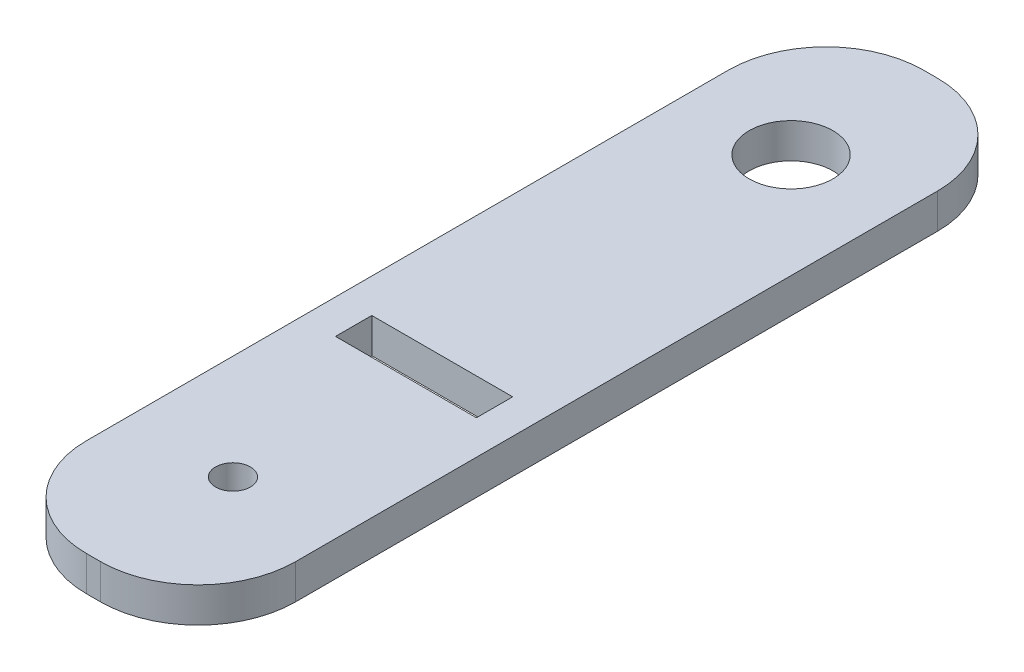
ISO-10303-21;
HEADER;
FILE_DESCRIPTION(('STEP AP214'),'2;1');
FILE_NAME('part.step','',(''),(''),'','','');
FILE_SCHEMA(('AUTOMOTIVE_DESIGN { 1 0 10303 214 1 1 1 1 }'));
ENDSEC;
DATA;
#1=APPLICATION_CONTEXT('core data for automotive mechanical design processes');
#2=APPLICATION_PROTOCOL_DEFINITION('international standard','automotive_design',2000,#1);
#3=PRODUCT_CONTEXT('',#1,'mechanical');
#4=PRODUCT('Part','Part','',(#3));
#5=PRODUCT_RELATED_PRODUCT_CATEGORY('part','',(#4));
#6=PRODUCT_DEFINITION_FORMATION('','',#4);
#7=PRODUCT_DEFINITION_CONTEXT('part definition',#1,'design');
#8=PRODUCT_DEFINITION('design','',#6,#7);
#9=PRODUCT_DEFINITION_SHAPE('','',#8);
#10=(LENGTH_UNIT() NAMED_UNIT(*) SI_UNIT(.MILLI.,.METRE.));
#11=(NAMED_UNIT(*) PLANE_ANGLE_UNIT() SI_UNIT($,.RADIAN.));
#12=(NAMED_UNIT(*) SI_UNIT($,.STERADIAN.) SOLID_ANGLE_UNIT());
#13=UNCERTAINTY_MEASURE_WITH_UNIT(LENGTH_MEASURE(1.E-05),#10,'distance_accuracy_value','');
#14=(GEOMETRIC_REPRESENTATION_CONTEXT(3) GLOBAL_UNCERTAINTY_ASSIGNED_CONTEXT((#13)) GLOBAL_UNIT_ASSIGNED_CONTEXT((#10,
#11,#12)) REPRESENTATION_CONTEXT('',''));
#15=CARTESIAN_POINT('',(0.,0.,0.));
#16=DIRECTION('',(0.,0.,1.));
#17=DIRECTION('',(1.,0.,0.));
#18=AXIS2_PLACEMENT_3D('',#15,#16,#17);
#19=CARTESIAN_POINT('',(-16.8898118207731,10.0001557639159,33.1505325625904));
#20=DIRECTION('',(0.,-1.,0.));
#21=DIRECTION('',(0.,0.,-1.));
#22=AXIS2_PLACEMENT_3D('',#19,#20,#21);
#23=CYLINDRICAL_SURFACE('',#22,8.89);
#24=DIRECTION('',(0.,-1.,0.));
#25=VECTOR('',#24,1.);
#26=CARTESIAN_POINT('',(-16.8898118207731,10.0001557639159,42.0405325625904));
#27=LINE('',#26,#25);
#28=CARTESIAN_POINT('',(-16.8898118207731,10.0001557639159,42.0405325625904));
#29=VERTEX_POINT('',#28);
#30=CARTESIAN_POINT('',(-16.8898118207731,6.82515576391594,42.0405325625904));
#31=VERTEX_POINT('',#30);
#32=EDGE_CURVE('E220',#29,#31,#27,.T.);
#33=ORIENTED_EDGE('',*,*,#32,.F.);
#34=CARTESIAN_POINT('',(-16.8898118207731,10.0001557639159,33.1505325625904));
#35=DIRECTION('',(0.,1.,0.));
#36=DIRECTION('',(0.,0.,1.));
#37=AXIS2_PLACEMENT_3D('',#34,#35,#36);
#38=CIRCLE('',#37,8.89);
#39=CARTESIAN_POINT('',(-25.7798118207731,10.0001557639159,33.1505325625904));
#40=VERTEX_POINT('',#39);
#41=EDGE_CURVE('E39',#40,#29,#38,.T.);
#42=ORIENTED_EDGE('',*,*,#41,.F.);
#43=DIRECTION('',(0.,-1.,0.));
#44=VECTOR('',#43,1.);
#45=CARTESIAN_POINT('',(-25.7798118207731,10.0001557639159,33.1505325625904));
#46=LINE('',#45,#44);
#47=CARTESIAN_POINT('',(-25.7798118207731,6.82515576391594,33.1505325625904));
#48=VERTEX_POINT('',#47);
#49=EDGE_CURVE('E223',#48,#40,#46,.F.);
#50=ORIENTED_EDGE('',*,*,#49,.F.);
#51=CARTESIAN_POINT('',(-16.8898118207731,6.82515576391594,33.1505325625904));
#52=DIRECTION('',(0.,1.,0.));
#53=DIRECTION('',(0.,0.,1.));
#54=AXIS2_PLACEMENT_3D('',#51,#52,#53);
#55=CIRCLE('',#54,8.89);
#56=EDGE_CURVE('E11',#31,#48,#55,.F.);
#57=ORIENTED_EDGE('',*,*,#56,.F.);
#58=EDGE_LOOP('',(#33,#42,#50,#57));
#59=FACE_BOUND('',#58,.T.);
#60=ADVANCED_FACE('F32',(#59),#23,.T.);
#61=CARTESIAN_POINT('',(-15.6198118207731,10.0001557639159,33.1505325625904));
#62=DIRECTION('',(0.,-1.,0.));
#63=DIRECTION('',(0.,0.,-1.));
#64=AXIS2_PLACEMENT_3D('',#61,#62,#63);
#65=CYLINDRICAL_SURFACE('',#64,8.89);
#66=DIRECTION('',(0.,-1.,0.));
#67=VECTOR('',#66,1.);
#68=CARTESIAN_POINT('',(-6.72981182077306,10.0001557639159,33.1505325625904));
#69=LINE('',#68,#67);
#70=CARTESIAN_POINT('',(-6.72981182077306,10.0001557639159,33.1505325625903));
#71=VERTEX_POINT('',#70);
#72=CARTESIAN_POINT('',(-6.72981182077306,6.82515576391594,33.1505325625903));
#73=VERTEX_POINT('',#72);
#74=EDGE_CURVE('E209',#71,#73,#69,.T.);
#75=ORIENTED_EDGE('',*,*,#74,.F.);
#76=CARTESIAN_POINT('',(-15.6198118207731,10.0001557639159,33.1505325625904));
#77=DIRECTION('',(0.,1.,0.));
#78=DIRECTION('',(0.,0.,1.));
#79=AXIS2_PLACEMENT_3D('',#76,#77,#78);
#80=CIRCLE('',#79,8.89);
#81=CARTESIAN_POINT('',(-15.6198118207731,10.0001557639159,42.0405325625904));
#82=VERTEX_POINT('',#81);
#83=EDGE_CURVE('E215',#82,#71,#80,.T.);
#84=ORIENTED_EDGE('',*,*,#83,.F.);
#85=DIRECTION('',(0.,-1.,0.));
#86=VECTOR('',#85,1.);
#87=CARTESIAN_POINT('',(-15.6198118207731,10.0001557639159,42.0405325625904));
#88=LINE('',#87,#86);
#89=CARTESIAN_POINT('',(-15.6198118207731,6.82515576391594,42.0405325625904));
#90=VERTEX_POINT('',#89);
#91=EDGE_CURVE('E212',#90,#82,#88,.F.);
#92=ORIENTED_EDGE('',*,*,#91,.F.);
#93=CARTESIAN_POINT('',(-15.6198118207731,6.82515576391594,33.1505325625904));
#94=DIRECTION('',(0.,1.,0.));
#95=DIRECTION('',(0.,0.,1.));
#96=AXIS2_PLACEMENT_3D('',#93,#94,#95);
#97=CIRCLE('',#96,8.89);
#98=EDGE_CURVE('E217',#73,#90,#97,.F.);
#99=ORIENTED_EDGE('',*,*,#98,.F.);
#100=EDGE_LOOP('',(#75,#84,#92,#99));
#101=FACE_BOUND('',#100,.T.);
#102=ADVANCED_FACE('F233',(#101),#65,.T.);
#103=CARTESIAN_POINT('',(-16.8898118207731,10.0001557639159,-25.2694674374096));
#104=DIRECTION('',(0.,1.,0.));
#105=DIRECTION('',(0.,0.,1.));
#106=AXIS2_PLACEMENT_3D('',#103,#104,#105);
#107=CYLINDRICAL_SURFACE('',#106,8.89);
#108=DIRECTION('',(0.,1.,0.));
#109=VECTOR('',#108,1.);
#110=CARTESIAN_POINT('',(-16.8898118207731,10.0001557639159,-34.1594674374096));
#111=LINE('',#110,#109);
#112=CARTESIAN_POINT('',(-16.8898118207731,6.82515576391594,-34.1594674374096));
#113=VERTEX_POINT('',#112);
#114=CARTESIAN_POINT('',(-16.8898118207731,10.0001557639159,-34.1594674374096));
#115=VERTEX_POINT('',#114);
#116=EDGE_CURVE('E199',#113,#115,#111,.T.);
#117=ORIENTED_EDGE('',*,*,#116,.F.);
#118=CARTESIAN_POINT('',(-16.8898118207731,6.82515576391594,-25.2694674374096));
#119=DIRECTION('',(0.,1.,0.));
#120=DIRECTION('',(0.,0.,1.));
#121=AXIS2_PLACEMENT_3D('',#118,#119,#120);
#122=CIRCLE('',#121,8.89);
#123=CARTESIAN_POINT('',(-25.7798118207731,6.82515576391594,-25.2694674374096));
#124=VERTEX_POINT('',#123);
#125=EDGE_CURVE('E205',#124,#113,#122,.F.);
#126=ORIENTED_EDGE('',*,*,#125,.F.);
#127=DIRECTION('',(0.,1.,0.));
#128=VECTOR('',#127,1.);
#129=CARTESIAN_POINT('',(-25.7798118207731,10.0001557639159,-25.2694674374096));
#130=LINE('',#129,#128);
#131=CARTESIAN_POINT('',(-25.7798118207731,10.0001557639159,-25.2694674374096));
#132=VERTEX_POINT('',#131);
#133=EDGE_CURVE('E202',#132,#124,#130,.F.);
#134=ORIENTED_EDGE('',*,*,#133,.F.);
#135=CARTESIAN_POINT('',(-16.8898118207731,10.0001557639159,-25.2694674374096));
#136=DIRECTION('',(0.,1.,0.));
#137=DIRECTION('',(0.,0.,1.));
#138=AXIS2_PLACEMENT_3D('',#135,#136,#137);
#139=CIRCLE('',#138,8.89);
#140=EDGE_CURVE('E207',#115,#132,#139,.T.);
#141=ORIENTED_EDGE('',*,*,#140,.F.);
#142=EDGE_LOOP('',(#117,#126,#134,#141));
#143=FACE_BOUND('',#142,.T.);
#144=ADVANCED_FACE('F252',(#143),#107,.T.);
#145=CARTESIAN_POINT('',(-15.6198118207731,10.0001557639159,-25.2694674374096));
#146=DIRECTION('',(0.,1.,0.));
#147=DIRECTION('',(0.,0.,1.));
#148=AXIS2_PLACEMENT_3D('',#145,#146,#147);
#149=CYLINDRICAL_SURFACE('',#148,8.89);
#150=DIRECTION('',(0.,1.,0.));
#151=VECTOR('',#150,1.);
#152=CARTESIAN_POINT('',(-6.72981182077307,10.0001557639159,-25.2694674374096));
#153=LINE('',#152,#151);
#154=CARTESIAN_POINT('',(-6.72981182077307,6.82515576391594,-25.2694674374096));
#155=VERTEX_POINT('',#154);
#156=CARTESIAN_POINT('',(-6.72981182077307,10.0001557639159,-25.2694674374096));
#157=VERTEX_POINT('',#156);
#158=EDGE_CURVE('E180',#155,#157,#153,.T.);
#159=ORIENTED_EDGE('',*,*,#158,.F.);
#160=CARTESIAN_POINT('',(-15.6198118207731,6.82515576391594,-25.2694674374096));
#161=DIRECTION('',(0.,1.,0.));
#162=DIRECTION('',(0.,0.,1.));
#163=AXIS2_PLACEMENT_3D('',#160,#161,#162);
#164=CIRCLE('',#163,8.89);
#165=CARTESIAN_POINT('',(-15.6198118207731,6.82515576391594,-34.1594674374096));
#166=VERTEX_POINT('',#165);
#167=EDGE_CURVE('E194',#166,#155,#164,.F.);
#168=ORIENTED_EDGE('',*,*,#167,.F.);
#169=DIRECTION('',(0.,1.,0.));
#170=VECTOR('',#169,1.);
#171=CARTESIAN_POINT('',(-15.6198118207731,10.0001557639159,-34.1594674374096));
#172=LINE('',#171,#170);
#173=CARTESIAN_POINT('',(-15.6198118207731,10.0001557639159,-34.1594674374096));
#174=VERTEX_POINT('',#173);
#175=EDGE_CURVE('E191',#174,#166,#172,.F.);
#176=ORIENTED_EDGE('',*,*,#175,.F.);
#177=CARTESIAN_POINT('',(-15.6198118207731,10.0001557639159,-25.2694674374096));
#178=DIRECTION('',(0.,1.,0.));
#179=DIRECTION('',(0.,0.,1.));
#180=AXIS2_PLACEMENT_3D('',#177,#178,#179);
#181=CIRCLE('',#180,8.89);
#182=EDGE_CURVE('E197',#157,#174,#181,.T.);
#183=ORIENTED_EDGE('',*,*,#182,.F.);
#184=EDGE_LOOP('',(#159,#168,#176,#183));
#185=FACE_BOUND('',#184,.T.);
#186=ADVANCED_FACE('F240',(#185),#149,.T.);
#187=CARTESIAN_POINT('',(-16.2548118207731,10.0001557639159,3.94053256259039));
#188=DIRECTION('',(0.,1.,0.));
#189=DIRECTION('',(0.,0.,1.));
#190=AXIS2_PLACEMENT_3D('',#187,#188,#189);
#191=PLANE('',#190);
#192=CARTESIAN_POINT('',(-16.2548118207731,10.0001557639159,29.3405325625904));
#193=DIRECTION('',(0.,1.,0.));
#194=DIRECTION('',(0.,0.,1.));
#195=AXIS2_PLACEMENT_3D('',#192,#193,#194);
#196=CIRCLE('',#195,1.5875);
#197=CARTESIAN_POINT('',(-16.2548118207731,10.0001557639159,30.9280325625904));
#198=VERTEX_POINT('',#197);
#199=EDGE_CURVE('E397',#198,#198,#196,.T.);
#200=ORIENTED_EDGE('',*,*,#199,.F.);
#201=EDGE_LOOP('',(#200));
#202=FACE_BOUND('',#201,.T.);
#203=CARTESIAN_POINT('',(-16.2548118207731,10.0001557639159,-21.4594674374096));
#204=DIRECTION('',(0.,1.,0.));
#205=DIRECTION('',(0.,0.,1.));
#206=AXIS2_PLACEMENT_3D('',#203,#204,#205);
#207=CIRCLE('',#206,3.81);
#208=CARTESIAN_POINT('',(-16.2548118207731,10.0001557639159,-17.6494674374096));
#209=VERTEX_POINT('',#208);
#210=EDGE_CURVE('E163',#209,#209,#207,.T.);
#211=ORIENTED_EDGE('',*,*,#210,.F.);
#212=EDGE_LOOP('',(#211));
#213=FACE_BOUND('',#212,.T.);
#214=DIRECTION('',(0.,0.,1.));
#215=VECTOR('',#214,1.);
#216=CARTESIAN_POINT('',(-25.7798118207731,10.0001557639159,-34.1594674374096));
#217=LINE('',#216,#215);
#218=EDGE_CURVE('E169',#132,#40,#217,.T.);
#219=ORIENTED_EDGE('',*,*,#218,.T.);
#220=ORIENTED_EDGE('',*,*,#41,.T.);
#221=DIRECTION('',(1.,0.,0.));
#222=VECTOR('',#221,1.);
#223=CARTESIAN_POINT('',(-25.7798118207731,10.0001557639159,42.0405325625904));
#224=LINE('',#223,#222);
#225=EDGE_CURVE('E172',#29,#82,#224,.T.);
#226=ORIENTED_EDGE('',*,*,#225,.T.);
#227=ORIENTED_EDGE('',*,*,#83,.T.);
#228=DIRECTION('',(0.,0.,-1.));
#229=VECTOR('',#228,1.);
#230=CARTESIAN_POINT('',(-6.72981182077307,10.0001557639159,-34.1594674374096));
#231=LINE('',#230,#229);
#232=EDGE_CURVE('E175',#71,#157,#231,.T.);
#233=ORIENTED_EDGE('',*,*,#232,.T.);
#234=ORIENTED_EDGE('',*,*,#182,.T.);
#235=DIRECTION('',(-1.,0.,0.));
#236=VECTOR('',#235,1.);
#237=CARTESIAN_POINT('',(-25.7798118207731,10.0001557639159,-34.1594674374096));
#238=LINE('',#237,#236);
#239=EDGE_CURVE('E177',#174,#115,#238,.T.);
#240=ORIENTED_EDGE('',*,*,#239,.T.);
#241=ORIENTED_EDGE('',*,*,#140,.T.);
#242=EDGE_LOOP('',(#219,#220,#226,#227,#233,#234,#240,#241));
#243=FACE_BOUND('',#242,.T.);
#244=DIRECTION('',(1.,0.,0.));
#245=VECTOR('',#244,1.);
#246=CARTESIAN_POINT('',(-22.6683118207731,10.0001557639159,13.5925325625904));
#247=LINE('',#246,#245);
#248=CARTESIAN_POINT('',(-22.6683118207731,10.0001557639159,13.5925325625904));
#249=VERTEX_POINT('',#248);
#250=CARTESIAN_POINT('',(-9.84131182077307,10.0001557639159,13.5925325625904));
#251=VERTEX_POINT('',#250);
#252=EDGE_CURVE('E129',#249,#251,#247,.T.);
#253=ORIENTED_EDGE('',*,*,#252,.F.);
#254=DIRECTION('',(0.,0.,1.));
#255=VECTOR('',#254,1.);
#256=CARTESIAN_POINT('',(-22.6683118207731,10.0001557639159,10.2905325625904));
#257=LINE('',#256,#255);
#258=CARTESIAN_POINT('',(-22.6683118207731,10.0001557639159,10.2905325625904));
#259=VERTEX_POINT('',#258);
#260=EDGE_CURVE('E119',#259,#249,#257,.T.);
#261=ORIENTED_EDGE('',*,*,#260,.F.);
#262=DIRECTION('',(-1.,0.,0.));
#263=VECTOR('',#262,1.);
#264=CARTESIAN_POINT('',(-22.6683118207731,10.0001557639159,10.2905325625904));
#265=LINE('',#264,#263);
#266=CARTESIAN_POINT('',(-9.84131182077307,10.0001557639159,10.2905325625904));
#267=VERTEX_POINT('',#266);
#268=EDGE_CURVE('E145',#267,#259,#265,.T.);
#269=ORIENTED_EDGE('',*,*,#268,.F.);
#270=DIRECTION('',(0.,0.,-1.));
#271=VECTOR('',#270,1.);
#272=CARTESIAN_POINT('',(-9.84131182077307,10.0001557639159,10.2905325625904));
#273=LINE('',#272,#271);
#274=EDGE_CURVE('E143',#251,#267,#273,.T.);
#275=ORIENTED_EDGE('',*,*,#274,.F.);
#276=EDGE_LOOP('',(#253,#261,#269,#275));
#277=FACE_BOUND('',#276,.T.);
#278=ADVANCED_FACE('F141',(#202,#213,#243,#277),#191,.T.);
#279=CARTESIAN_POINT('',(-16.2548118207731,6.82515576391594,3.94053256259039));
#280=DIRECTION('',(0.,1.,0.));
#281=DIRECTION('',(0.,0.,1.));
#282=AXIS2_PLACEMENT_3D('',#279,#280,#281);
#283=PLANE('',#282);
#284=CARTESIAN_POINT('',(-16.2548118207731,6.82515576391594,29.3405325625904));
#285=DIRECTION('',(0.,1.,0.));
#286=DIRECTION('',(0.,0.,1.));
#287=AXIS2_PLACEMENT_3D('',#284,#285,#286);
#288=CIRCLE('',#287,1.5875);
#289=CARTESIAN_POINT('',(-16.2548118207731,6.82515576391594,30.9280325625904));
#290=VERTEX_POINT('',#289);
#291=EDGE_CURVE('E152',#290,#290,#288,.T.);
#292=ORIENTED_EDGE('',*,*,#291,.T.);
#293=EDGE_LOOP('',(#292));
#294=FACE_BOUND('',#293,.T.);
#295=CARTESIAN_POINT('',(-16.2548118207731,6.82515576391594,-21.4594674374096));
#296=DIRECTION('',(0.,1.,0.));
#297=DIRECTION('',(0.,0.,1.));
#298=AXIS2_PLACEMENT_3D('',#295,#296,#297);
#299=CIRCLE('',#298,3.81);
#300=CARTESIAN_POINT('',(-16.2548118207731,6.82515576391594,-17.6494674374096));
#301=VERTEX_POINT('',#300);
#302=EDGE_CURVE('E137',#301,#301,#299,.T.);
#303=ORIENTED_EDGE('',*,*,#302,.T.);
#304=EDGE_LOOP('',(#303));
#305=FACE_BOUND('',#304,.T.);
#306=DIRECTION('',(1.,0.,0.));
#307=VECTOR('',#306,1.);
#308=CARTESIAN_POINT('',(-25.7798118207731,6.82515576391594,42.0405325625904));
#309=LINE('',#308,#307);
#310=EDGE_CURVE('E183',#31,#90,#309,.T.);
#311=ORIENTED_EDGE('',*,*,#310,.F.);
#312=ORIENTED_EDGE('',*,*,#56,.T.);
#313=DIRECTION('',(0.,0.,1.));
#314=VECTOR('',#313,1.);
#315=CARTESIAN_POINT('',(-25.7798118207731,6.82515576391594,-34.1594674374096));
#316=LINE('',#315,#314);
#317=EDGE_CURVE('E166',#124,#48,#316,.T.);
#318=ORIENTED_EDGE('',*,*,#317,.F.);
#319=ORIENTED_EDGE('',*,*,#125,.T.);
#320=DIRECTION('',(-1.,0.,0.));
#321=VECTOR('',#320,1.);
#322=CARTESIAN_POINT('',(-25.7798118207731,6.82515576391594,-34.1594674374096));
#323=LINE('',#322,#321);
#324=EDGE_CURVE('E173',#166,#113,#323,.T.);
#325=ORIENTED_EDGE('',*,*,#324,.F.);
#326=ORIENTED_EDGE('',*,*,#167,.T.);
#327=DIRECTION('',(0.,0.,-1.));
#328=VECTOR('',#327,1.);
#329=CARTESIAN_POINT('',(-6.72981182077307,6.82515576391594,-34.1594674374096));
#330=LINE('',#329,#328);
#331=EDGE_CURVE('E185',#73,#155,#330,.T.);
#332=ORIENTED_EDGE('',*,*,#331,.F.);
#333=ORIENTED_EDGE('',*,*,#98,.T.);
#334=EDGE_LOOP('',(#311,#312,#318,#319,#325,#326,#332,#333));
#335=FACE_BOUND('',#334,.T.);
#336=DIRECTION('',(0.,0.,1.));
#337=VECTOR('',#336,1.);
#338=CARTESIAN_POINT('',(-22.6683118207731,6.82515576391594,10.2905325625904));
#339=LINE('',#338,#337);
#340=CARTESIAN_POINT('',(-22.6683118207731,6.82515576391594,10.2905325625904));
#341=VERTEX_POINT('',#340);
#342=CARTESIAN_POINT('',(-22.6683118207731,6.82515576391594,13.5925325625904));
#343=VERTEX_POINT('',#342);
#344=EDGE_CURVE('E150',#341,#343,#339,.T.);
#345=ORIENTED_EDGE('',*,*,#344,.T.);
#346=DIRECTION('',(1.,0.,0.));
#347=VECTOR('',#346,1.);
#348=CARTESIAN_POINT('',(-22.6683118207731,6.82515576391594,13.5925325625904));
#349=LINE('',#348,#347);
#350=CARTESIAN_POINT('',(-9.84131182077307,6.82515576391594,13.5925325625904));
#351=VERTEX_POINT('',#350);
#352=EDGE_CURVE('E136',#343,#351,#349,.T.);
#353=ORIENTED_EDGE('',*,*,#352,.T.);
#354=DIRECTION('',(0.,0.,-1.));
#355=VECTOR('',#354,1.);
#356=CARTESIAN_POINT('',(-9.84131182077307,6.82515576391594,10.2905325625904));
#357=LINE('',#356,#355);
#358=CARTESIAN_POINT('',(-9.84131182077307,6.82515576391594,10.2905325625904));
#359=VERTEX_POINT('',#358);
#360=EDGE_CURVE('E154',#351,#359,#357,.T.);
#361=ORIENTED_EDGE('',*,*,#360,.T.);
#362=DIRECTION('',(-1.,0.,0.));
#363=VECTOR('',#362,1.);
#364=CARTESIAN_POINT('',(-22.6683118207731,6.82515576391594,10.2905325625904));
#365=LINE('',#364,#363);
#366=EDGE_CURVE('E130',#359,#341,#365,.T.);
#367=ORIENTED_EDGE('',*,*,#366,.T.);
#368=EDGE_LOOP('',(#345,#353,#361,#367));
#369=FACE_BOUND('',#368,.T.);
#370=ADVANCED_FACE('F245',(#294,#305,#335,#369),#283,.F.);
#371=CARTESIAN_POINT('',(-25.7798118207731,10.0001557639159,-34.1594674374096));
#372=DIRECTION('',(1.,0.,0.));
#373=DIRECTION('',(0.,0.,-1.));
#374=AXIS2_PLACEMENT_3D('',#371,#372,#373);
#375=PLANE('',#374);
#376=ORIENTED_EDGE('',*,*,#317,.T.);
#377=ORIENTED_EDGE('',*,*,#49,.T.);
#378=ORIENTED_EDGE('',*,*,#218,.F.);
#379=ORIENTED_EDGE('',*,*,#133,.T.);
#380=EDGE_LOOP('',(#376,#377,#378,#379));
#381=FACE_BOUND('',#380,.T.);
#382=ADVANCED_FACE('F254',(#381),#375,.F.);
#383=CARTESIAN_POINT('',(-25.7798118207731,10.0001557639159,42.0405325625904));
#384=DIRECTION('',(0.,0.,-1.));
#385=DIRECTION('',(-1.,0.,0.));
#386=AXIS2_PLACEMENT_3D('',#383,#384,#385);
#387=PLANE('',#386);
#388=ORIENTED_EDGE('',*,*,#225,.F.);
#389=ORIENTED_EDGE('',*,*,#32,.T.);
#390=ORIENTED_EDGE('',*,*,#310,.T.);
#391=ORIENTED_EDGE('',*,*,#91,.T.);
#392=EDGE_LOOP('',(#388,#389,#390,#391));
#393=FACE_BOUND('',#392,.T.);
#394=ADVANCED_FACE('F229',(#393),#387,.F.);
#395=CARTESIAN_POINT('',(-6.72981182077307,10.0001557639159,-34.1594674374096));
#396=DIRECTION('',(-1.,0.,0.));
#397=DIRECTION('',(0.,0.,1.));
#398=AXIS2_PLACEMENT_3D('',#395,#396,#397);
#399=PLANE('',#398);
#400=ORIENTED_EDGE('',*,*,#232,.F.);
#401=ORIENTED_EDGE('',*,*,#74,.T.);
#402=ORIENTED_EDGE('',*,*,#331,.T.);
#403=ORIENTED_EDGE('',*,*,#158,.T.);
#404=EDGE_LOOP('',(#400,#401,#402,#403));
#405=FACE_BOUND('',#404,.T.);
#406=ADVANCED_FACE('F242',(#405),#399,.F.);
#407=CARTESIAN_POINT('',(-25.7798118207731,10.0001557639159,-34.1594674374096));
#408=DIRECTION('',(0.,0.,1.));
#409=DIRECTION('',(1.,0.,0.));
#410=AXIS2_PLACEMENT_3D('',#407,#408,#409);
#411=PLANE('',#410);
#412=ORIENTED_EDGE('',*,*,#324,.T.);
#413=ORIENTED_EDGE('',*,*,#116,.T.);
#414=ORIENTED_EDGE('',*,*,#239,.F.);
#415=ORIENTED_EDGE('',*,*,#175,.T.);
#416=EDGE_LOOP('',(#412,#413,#414,#415));
#417=FACE_BOUND('',#416,.T.);
#418=ADVANCED_FACE('F248',(#417),#411,.F.);
#419=CARTESIAN_POINT('',(-16.2548118207731,10.0001557639159,-21.4594674374096));
#420=DIRECTION('',(0.,-1.,0.));
#421=DIRECTION('',(0.,0.,-1.));
#422=AXIS2_PLACEMENT_3D('',#419,#420,#421);
#423=CYLINDRICAL_SURFACE('',#422,3.81);
#424=ORIENTED_EDGE('',*,*,#210,.T.);
#425=EDGE_LOOP('',(#424));
#426=FACE_BOUND('',#425,.T.);
#427=ORIENTED_EDGE('',*,*,#302,.F.);
#428=EDGE_LOOP('',(#427));
#429=FACE_BOUND('',#428,.T.);
#430=ADVANCED_FACE('F284',(#426,#429),#423,.F.);
#431=CARTESIAN_POINT('',(-22.6683118207731,10.0001557639159,10.2905325625904));
#432=DIRECTION('',(1.,0.,0.));
#433=DIRECTION('',(0.,0.,-1.));
#434=AXIS2_PLACEMENT_3D('',#431,#432,#433);
#435=PLANE('',#434);
#436=ORIENTED_EDGE('',*,*,#344,.F.);
#437=DIRECTION('',(0.,-1.,0.));
#438=VECTOR('',#437,1.);
#439=CARTESIAN_POINT('',(-22.6683118207731,10.0001557639159,10.2905325625904));
#440=LINE('',#439,#438);
#441=EDGE_CURVE('E125',#259,#341,#440,.T.);
#442=ORIENTED_EDGE('',*,*,#441,.F.);
#443=ORIENTED_EDGE('',*,*,#260,.T.);
#444=DIRECTION('',(0.,-1.,0.));
#445=VECTOR('',#444,1.);
#446=CARTESIAN_POINT('',(-22.6683118207731,10.0001557639159,13.5925325625904));
#447=LINE('',#446,#445);
#448=EDGE_CURVE('E122',#249,#343,#447,.T.);
#449=ORIENTED_EDGE('',*,*,#448,.T.);
#450=EDGE_LOOP('',(#436,#442,#443,#449));
#451=FACE_BOUND('',#450,.T.);
#452=ADVANCED_FACE('F121',(#451),#435,.T.);
#453=CARTESIAN_POINT('',(-22.6683118207731,10.0001557639159,13.5925325625904));
#454=DIRECTION('',(0.,0.,-1.));
#455=DIRECTION('',(-1.,0.,0.));
#456=AXIS2_PLACEMENT_3D('',#453,#454,#455);
#457=PLANE('',#456);
#458=ORIENTED_EDGE('',*,*,#352,.F.);
#459=ORIENTED_EDGE('',*,*,#448,.F.);
#460=ORIENTED_EDGE('',*,*,#252,.T.);
#461=DIRECTION('',(0.,-1.,0.));
#462=VECTOR('',#461,1.);
#463=CARTESIAN_POINT('',(-9.84131182077307,10.0001557639159,13.5925325625904));
#464=LINE('',#463,#462);
#465=EDGE_CURVE('E138',#251,#351,#464,.T.);
#466=ORIENTED_EDGE('',*,*,#465,.T.);
#467=EDGE_LOOP('',(#458,#459,#460,#466));
#468=FACE_BOUND('',#467,.T.);
#469=ADVANCED_FACE('F133',(#468),#457,.T.);
#470=CARTESIAN_POINT('',(-9.84131182077307,10.0001557639159,10.2905325625904));
#471=DIRECTION('',(-1.,0.,0.));
#472=DIRECTION('',(0.,0.,1.));
#473=AXIS2_PLACEMENT_3D('',#470,#471,#472);
#474=PLANE('',#473);
#475=ORIENTED_EDGE('',*,*,#360,.F.);
#476=ORIENTED_EDGE('',*,*,#465,.F.);
#477=ORIENTED_EDGE('',*,*,#274,.T.);
#478=DIRECTION('',(0.,-1.,0.));
#479=VECTOR('',#478,1.);
#480=CARTESIAN_POINT('',(-9.84131182077307,10.0001557639159,10.2905325625904));
#481=LINE('',#480,#479);
#482=EDGE_CURVE('E160',#267,#359,#481,.T.);
#483=ORIENTED_EDGE('',*,*,#482,.T.);
#484=EDGE_LOOP('',(#475,#476,#477,#483));
#485=FACE_BOUND('',#484,.T.);
#486=ADVANCED_FACE('F315',(#485),#474,.T.);
#487=CARTESIAN_POINT('',(-22.6683118207731,10.0001557639159,10.2905325625904));
#488=DIRECTION('',(0.,0.,1.));
#489=DIRECTION('',(1.,0.,0.));
#490=AXIS2_PLACEMENT_3D('',#487,#488,#489);
#491=PLANE('',#490);
#492=ORIENTED_EDGE('',*,*,#366,.F.);
#493=ORIENTED_EDGE('',*,*,#482,.F.);
#494=ORIENTED_EDGE('',*,*,#268,.T.);
#495=ORIENTED_EDGE('',*,*,#441,.T.);
#496=EDGE_LOOP('',(#492,#493,#494,#495));
#497=FACE_BOUND('',#496,.T.);
#498=ADVANCED_FACE('F322',(#497),#491,.T.);
#499=CARTESIAN_POINT('',(-16.2548118207731,6.82515576391594,29.3405325625904));
#500=DIRECTION('',(0.,1.,0.));
#501=DIRECTION('',(0.,0.,1.));
#502=AXIS2_PLACEMENT_3D('',#499,#500,#501);
#503=CYLINDRICAL_SURFACE('',#502,1.5875);
#504=ORIENTED_EDGE('',*,*,#291,.F.);
#505=EDGE_LOOP('',(#504));
#506=FACE_BOUND('',#505,.T.);
#507=ORIENTED_EDGE('',*,*,#199,.T.);
#508=EDGE_LOOP('',(#507));
#509=FACE_BOUND('',#508,.T.);
#510=ADVANCED_FACE('F330',(#506,#509),#503,.F.);
#511=CLOSED_SHELL('',(#60,#102,#144,#186,#278,#370,#382,#394,#406,#418,#430,#452,#469,#486,#498,#510));
#512=MANIFOLD_SOLID_BREP('B2',#511);
#513=ADVANCED_BREP_SHAPE_REPRESENTATION('',(#18,#512),#14);
#514=SHAPE_DEFINITION_REPRESENTATION(#9,#513);
ENDSEC;
END-ISO-10303-21;
